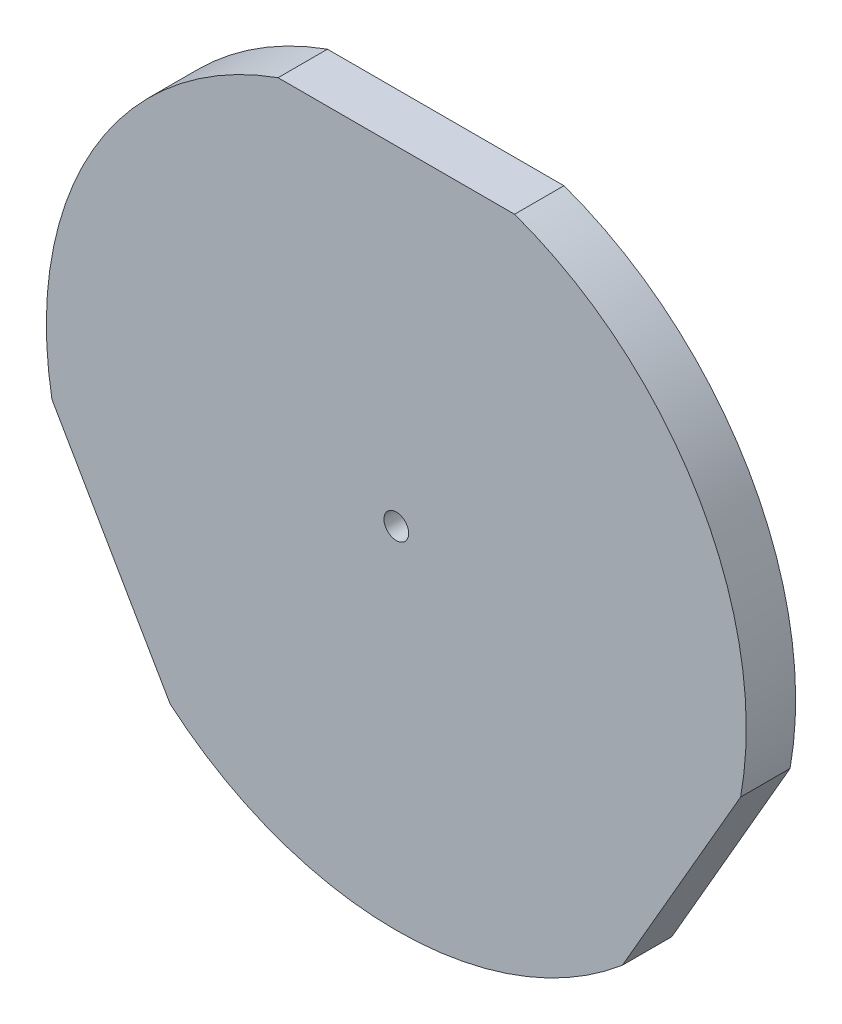
ISO-10303-21;
HEADER;
FILE_DESCRIPTION(('STEP AP214'),'2;1');
FILE_NAME('part.step','',(''),(''),'','','');
FILE_SCHEMA(('AUTOMOTIVE_DESIGN { 1 0 10303 214 1 1 1 1 }'));
ENDSEC;
DATA;
#1=APPLICATION_CONTEXT('core data for automotive mechanical design processes');
#2=APPLICATION_PROTOCOL_DEFINITION('international standard','automotive_design',2000,#1);
#3=PRODUCT_CONTEXT('',#1,'mechanical');
#4=PRODUCT('Part','Part','',(#3));
#5=PRODUCT_RELATED_PRODUCT_CATEGORY('part','',(#4));
#6=PRODUCT_DEFINITION_FORMATION('','',#4);
#7=PRODUCT_DEFINITION_CONTEXT('part definition',#1,'design');
#8=PRODUCT_DEFINITION('design','',#6,#7);
#9=PRODUCT_DEFINITION_SHAPE('','',#8);
#10=(LENGTH_UNIT() NAMED_UNIT(*) SI_UNIT(.MILLI.,.METRE.));
#11=(NAMED_UNIT(*) PLANE_ANGLE_UNIT() SI_UNIT($,.RADIAN.));
#12=(NAMED_UNIT(*) SI_UNIT($,.STERADIAN.) SOLID_ANGLE_UNIT());
#13=UNCERTAINTY_MEASURE_WITH_UNIT(LENGTH_MEASURE(1.E-05),#10,'distance_accuracy_value','');
#14=(GEOMETRIC_REPRESENTATION_CONTEXT(3) GLOBAL_UNCERTAINTY_ASSIGNED_CONTEXT((#13)) GLOBAL_UNIT_ASSIGNED_CONTEXT((#10,
#11,#12)) REPRESENTATION_CONTEXT('',''));
#15=CARTESIAN_POINT('',(0.,0.,0.));
#16=DIRECTION('',(0.,0.,1.));
#17=DIRECTION('',(1.,0.,0.));
#18=AXIS2_PLACEMENT_3D('',#15,#16,#17);
#19=CARTESIAN_POINT('',(0.,0.,12.));
#20=DIRECTION('',(0.,0.,-1.));
#21=DIRECTION('',(-1.,0.,0.));
#22=AXIS2_PLACEMENT_3D('',#19,#20,#21);
#23=CYLINDRICAL_SURFACE('',#22,85.);
#24=CARTESIAN_POINT('',(0.,0.,12.));
#25=DIRECTION('',(0.,0.,1.));
#26=DIRECTION('',(1.,0.,0.));
#27=AXIS2_PLACEMENT_3D('',#24,#25,#26);
#28=CIRCLE('',#27,85.);
#29=CARTESIAN_POINT('',(-54.9206256864105,-64.8746859276651,12.));
#30=VERTEX_POINT('',#29);
#31=CARTESIAN_POINT('',(54.9206256864096,-64.8746859276659,12.));
#32=VERTEX_POINT('',#31);
#33=EDGE_CURVE('E55',#30,#32,#28,.T.);
#34=ORIENTED_EDGE('',*,*,#33,.F.);
#35=DIRECTION('',(0.,0.,1.));
#36=VECTOR('',#35,1.);
#37=CARTESIAN_POINT('',(-54.9206256864105,-64.8746859276651,-0.000999999999999265));
#38=LINE('',#37,#36);
#39=CARTESIAN_POINT('',(-54.9206256864106,-64.8746859276651,0.));
#40=VERTEX_POINT('',#39);
#41=EDGE_CURVE('E102',#40,#30,#38,.T.);
#42=ORIENTED_EDGE('',*,*,#41,.F.);
#43=CARTESIAN_POINT('',(0.,0.,0.));
#44=DIRECTION('',(0.,0.,1.));
#45=DIRECTION('',(1.,0.,0.));
#46=AXIS2_PLACEMENT_3D('',#43,#44,#45);
#47=CIRCLE('',#46,85.);
#48=CARTESIAN_POINT('',(54.9206256864097,-64.8746859276659,0.));
#49=VERTEX_POINT('',#48);
#50=EDGE_CURVE('E112',#40,#49,#47,.T.);
#51=ORIENTED_EDGE('',*,*,#50,.T.);
#52=DIRECTION('',(0.,0.,1.));
#53=VECTOR('',#52,1.);
#54=CARTESIAN_POINT('',(54.9206256864097,-64.8746859276659,-0.000999999999999265));
#55=LINE('',#54,#53);
#56=EDGE_CURVE('E144',#49,#32,#55,.T.);
#57=ORIENTED_EDGE('',*,*,#56,.T.);
#58=EDGE_LOOP('',(#34,#42,#51,#57));
#59=FACE_BOUND('',#58,.T.);
#60=ADVANCED_FACE('F46',(#59),#23,.T.);
#61=CARTESIAN_POINT('',(83.6434389191002,-15.1253140723348,12.));
#62=VERTEX_POINT('',#61);
#63=CARTESIAN_POINT('',(28.7228132326903,80.,12.));
#64=VERTEX_POINT('',#63);
#65=EDGE_CURVE('E56',#62,#64,#28,.T.);
#66=ORIENTED_EDGE('',*,*,#65,.F.);
#67=DIRECTION('',(0.,0.,1.));
#68=VECTOR('',#67,1.);
#69=CARTESIAN_POINT('',(83.6434389191002,-15.1253140723348,-0.000999999999999265));
#70=LINE('',#69,#68);
#71=CARTESIAN_POINT('',(83.6434389191001,-15.1253140723349,0.));
#72=VERTEX_POINT('',#71);
#73=EDGE_CURVE('E145',#72,#62,#70,.T.);
#74=ORIENTED_EDGE('',*,*,#73,.F.);
#75=CARTESIAN_POINT('',(28.7228132326903,80.,0.));
#76=VERTEX_POINT('',#75);
#77=EDGE_CURVE('E120',#72,#76,#47,.T.);
#78=ORIENTED_EDGE('',*,*,#77,.T.);
#79=DIRECTION('',(0.,0.,1.));
#80=VECTOR('',#79,1.);
#81=CARTESIAN_POINT('',(28.7228132326903,80.,-0.000999999999999265));
#82=LINE('',#81,#80);
#83=EDGE_CURVE('E136',#76,#64,#82,.T.);
#84=ORIENTED_EDGE('',*,*,#83,.T.);
#85=EDGE_LOOP('',(#66,#74,#78,#84));
#86=FACE_BOUND('',#85,.T.);
#87=ADVANCED_FACE('F160',(#86),#23,.T.);
#88=CARTESIAN_POINT('',(0.,0.,12.));
#89=DIRECTION('',(0.,0.,1.));
#90=DIRECTION('',(1.,0.,0.));
#91=AXIS2_PLACEMENT_3D('',#88,#89,#90);
#92=PLANE('',#91);
#93=DIRECTION('',(-0.499999999999992,0.866025403784443,0.));
#94=VECTOR('',#93,1.);
#95=CARTESIAN_POINT('',(-54.9206256864105,-64.8746859276651,12.));
#96=LINE('',#95,#94);
#97=CARTESIAN_POINT('',(-83.6434389191003,-15.1253140723336,12.));
#98=VERTEX_POINT('',#97);
#99=EDGE_CURVE('E63',#30,#98,#96,.T.);
#100=ORIENTED_EDGE('',*,*,#99,.F.);
#101=ORIENTED_EDGE('',*,*,#33,.T.);
#102=DIRECTION('',(-0.500000000000004,-0.866025403784436,0.));
#103=VECTOR('',#102,1.);
#104=CARTESIAN_POINT('',(83.6434389191002,-15.1253140723348,12.));
#105=LINE('',#104,#103);
#106=EDGE_CURVE('E108',#62,#32,#105,.T.);
#107=ORIENTED_EDGE('',*,*,#106,.F.);
#108=ORIENTED_EDGE('',*,*,#65,.T.);
#109=DIRECTION('',(1.,0.,0.));
#110=VECTOR('',#109,1.);
#111=CARTESIAN_POINT('',(-28.7228132326903,80.,12.));
#112=LINE('',#111,#110);
#113=CARTESIAN_POINT('',(-28.7228132326903,80.,12.));
#114=VERTEX_POINT('',#113);
#115=EDGE_CURVE('E139',#114,#64,#112,.T.);
#116=ORIENTED_EDGE('',*,*,#115,.F.);
#117=EDGE_CURVE('E13',#114,#98,#28,.T.);
#118=ORIENTED_EDGE('',*,*,#117,.T.);
#119=EDGE_LOOP('',(#100,#101,#107,#108,#116,#118));
#120=FACE_BOUND('',#119,.T.);
#121=CARTESIAN_POINT('',(0.,0.,12.));
#122=DIRECTION('',(0.,0.,1.));
#123=DIRECTION('',(1.,0.,0.));
#124=AXIS2_PLACEMENT_3D('',#121,#122,#123);
#125=CIRCLE('',#124,3.);
#126=CARTESIAN_POINT('',(3.,0.,12.));
#127=VERTEX_POINT('',#126);
#128=EDGE_CURVE('E121',#127,#127,#125,.T.);
#129=ORIENTED_EDGE('',*,*,#128,.F.);
#130=EDGE_LOOP('',(#129));
#131=FACE_BOUND('',#130,.T.);
#132=ADVANCED_FACE('F154',(#120,#131),#92,.T.);
#133=CARTESIAN_POINT('',(0.,0.,0.));
#134=DIRECTION('',(0.,0.,1.));
#135=DIRECTION('',(1.,0.,0.));
#136=AXIS2_PLACEMENT_3D('',#133,#134,#135);
#137=PLANE('',#136);
#138=ORIENTED_EDGE('',*,*,#50,.F.);
#139=DIRECTION('',(0.499999999999992,-0.866025403784443,0.));
#140=VECTOR('',#139,1.);
#141=CARTESIAN_POINT('',(-54.9206256864105,-64.8746859276651,0.));
#142=LINE('',#141,#140);
#143=CARTESIAN_POINT('',(-83.6434389191004,-15.1253140723336,0.));
#144=VERTEX_POINT('',#143);
#145=EDGE_CURVE('E99',#144,#40,#142,.T.);
#146=ORIENTED_EDGE('',*,*,#145,.F.);
#147=CARTESIAN_POINT('',(-28.7228132326902,80.,0.));
#148=VERTEX_POINT('',#147);
#149=EDGE_CURVE('E50',#148,#144,#47,.T.);
#150=ORIENTED_EDGE('',*,*,#149,.F.);
#151=DIRECTION('',(-1.,0.,0.));
#152=VECTOR('',#151,1.);
#153=CARTESIAN_POINT('',(-28.7228132326903,80.,0.));
#154=LINE('',#153,#152);
#155=EDGE_CURVE('E132',#76,#148,#154,.T.);
#156=ORIENTED_EDGE('',*,*,#155,.F.);
#157=ORIENTED_EDGE('',*,*,#77,.F.);
#158=DIRECTION('',(0.500000000000004,0.866025403784436,0.));
#159=VECTOR('',#158,1.);
#160=CARTESIAN_POINT('',(83.6434389191002,-15.1253140723348,0.));
#161=LINE('',#160,#159);
#162=EDGE_CURVE('E119',#49,#72,#161,.T.);
#163=ORIENTED_EDGE('',*,*,#162,.F.);
#164=EDGE_LOOP('',(#138,#146,#150,#156,#157,#163));
#165=FACE_BOUND('',#164,.T.);
#166=CARTESIAN_POINT('',(0.,0.,0.));
#167=DIRECTION('',(0.,0.,1.));
#168=DIRECTION('',(1.,0.,0.));
#169=AXIS2_PLACEMENT_3D('',#166,#167,#168);
#170=CIRCLE('',#169,3.);
#171=CARTESIAN_POINT('',(3.,0.,0.));
#172=VERTEX_POINT('',#171);
#173=EDGE_CURVE('E127',#172,#172,#170,.T.);
#174=ORIENTED_EDGE('',*,*,#173,.T.);
#175=EDGE_LOOP('',(#174));
#176=FACE_BOUND('',#175,.T.);
#177=ADVANCED_FACE('F116',(#165,#176),#137,.F.);
#178=ORIENTED_EDGE('',*,*,#149,.T.);
#179=DIRECTION('',(0.,0.,1.));
#180=VECTOR('',#179,1.);
#181=CARTESIAN_POINT('',(-83.6434389191004,-15.1253140723336,-0.000999999999999265));
#182=LINE('',#181,#180);
#183=EDGE_CURVE('E103',#144,#98,#182,.T.);
#184=ORIENTED_EDGE('',*,*,#183,.T.);
#185=ORIENTED_EDGE('',*,*,#117,.F.);
#186=DIRECTION('',(0.,0.,1.));
#187=VECTOR('',#186,1.);
#188=CARTESIAN_POINT('',(-28.7228132326903,80.,-0.000999999999999265));
#189=LINE('',#188,#187);
#190=EDGE_CURVE('E137',#148,#114,#189,.T.);
#191=ORIENTED_EDGE('',*,*,#190,.F.);
#192=EDGE_LOOP('',(#178,#184,#185,#191));
#193=FACE_BOUND('',#192,.T.);
#194=ADVANCED_FACE('F48',(#193),#23,.T.);
#195=CARTESIAN_POINT('',(0.,0.,12.));
#196=DIRECTION('',(0.,0.,-1.));
#197=DIRECTION('',(-1.,0.,0.));
#198=AXIS2_PLACEMENT_3D('',#195,#196,#197);
#199=CYLINDRICAL_SURFACE('',#198,3.);
#200=ORIENTED_EDGE('',*,*,#128,.T.);
#201=EDGE_LOOP('',(#200));
#202=FACE_BOUND('',#201,.T.);
#203=ORIENTED_EDGE('',*,*,#173,.F.);
#204=EDGE_LOOP('',(#203));
#205=FACE_BOUND('',#204,.T.);
#206=ADVANCED_FACE('F170',(#202,#205),#199,.F.);
#207=CARTESIAN_POINT('',(-28.7228132326903,80.,-0.000999999999999265));
#208=DIRECTION('',(0.,-1.,0.));
#209=DIRECTION('',(0.,0.,-1.));
#210=AXIS2_PLACEMENT_3D('',#207,#208,#209);
#211=PLANE('',#210);
#212=ORIENTED_EDGE('',*,*,#155,.T.);
#213=ORIENTED_EDGE('',*,*,#190,.T.);
#214=ORIENTED_EDGE('',*,*,#115,.T.);
#215=ORIENTED_EDGE('',*,*,#83,.F.);
#216=EDGE_LOOP('',(#212,#213,#214,#215));
#217=FACE_BOUND('',#216,.T.);
#218=ADVANCED_FACE('F158',(#217),#211,.F.);
#219=CARTESIAN_POINT('',(83.6434389191002,-15.1253140723348,-0.000999999999999265));
#220=DIRECTION('',(-0.866025403784436,0.500000000000004,0.));
#221=DIRECTION('',(-0.500000000000004,-0.866025403784436,0.));
#222=AXIS2_PLACEMENT_3D('',#219,#220,#221);
#223=PLANE('',#222);
#224=ORIENTED_EDGE('',*,*,#162,.T.);
#225=ORIENTED_EDGE('',*,*,#73,.T.);
#226=ORIENTED_EDGE('',*,*,#106,.T.);
#227=ORIENTED_EDGE('',*,*,#56,.F.);
#228=EDGE_LOOP('',(#224,#225,#226,#227));
#229=FACE_BOUND('',#228,.T.);
#230=ADVANCED_FACE('F162',(#229),#223,.F.);
#231=CARTESIAN_POINT('',(-54.9206256864105,-64.8746859276651,-0.000999999999999265));
#232=DIRECTION('',(0.866025403784443,0.499999999999992,0.));
#233=DIRECTION('',(-0.499999999999992,0.866025403784443,0.));
#234=AXIS2_PLACEMENT_3D('',#231,#232,#233);
#235=PLANE('',#234);
#236=ORIENTED_EDGE('',*,*,#145,.T.);
#237=ORIENTED_EDGE('',*,*,#41,.T.);
#238=ORIENTED_EDGE('',*,*,#99,.T.);
#239=ORIENTED_EDGE('',*,*,#183,.F.);
#240=EDGE_LOOP('',(#236,#237,#238,#239));
#241=FACE_BOUND('',#240,.T.);
#242=ADVANCED_FACE('F101',(#241),#235,.F.);
#243=CLOSED_SHELL('',(#60,#87,#132,#177,#194,#206,#218,#230,#242));
#244=MANIFOLD_SOLID_BREP('B2',#243);
#245=ADVANCED_BREP_SHAPE_REPRESENTATION('',(#18,#244),#14);
#246=SHAPE_DEFINITION_REPRESENTATION(#9,#245);
ENDSEC;
END-ISO-10303-21;
